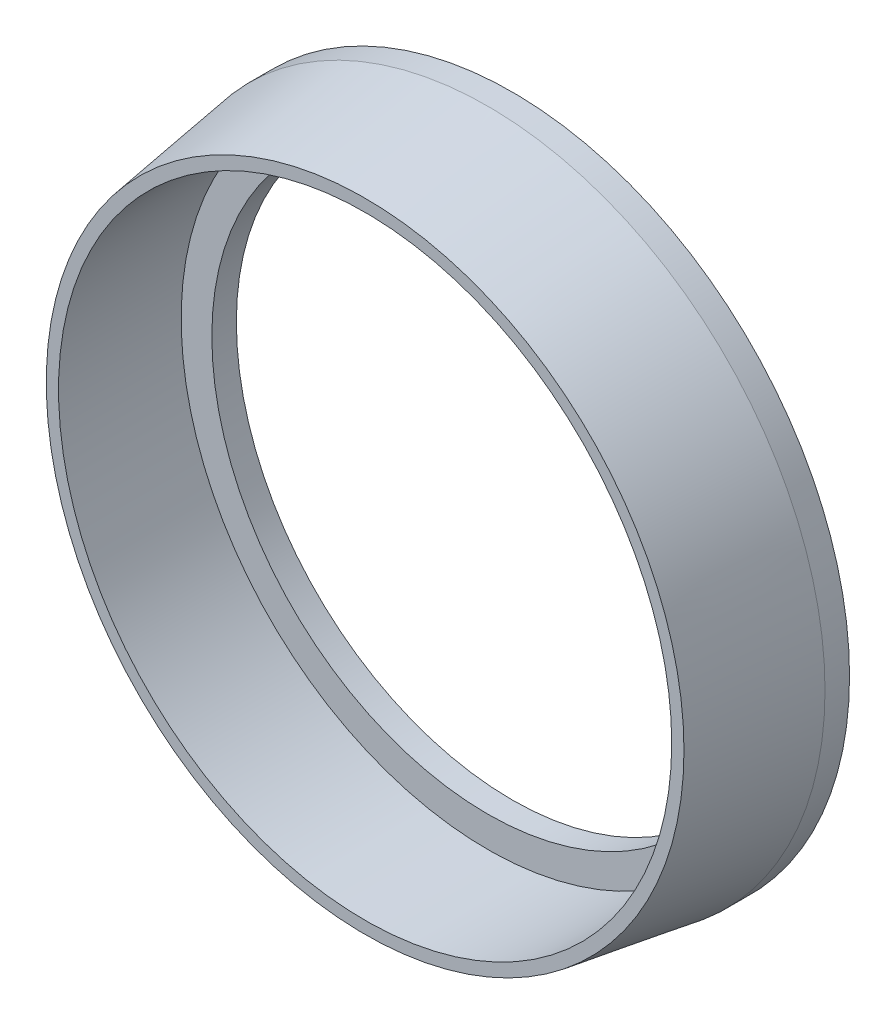
ISO-10303-21;
HEADER;
FILE_DESCRIPTION(('STEP AP214'),'2;1');
FILE_NAME('part.step','',(''),(''),'','','');
FILE_SCHEMA(('AUTOMOTIVE_DESIGN { 1 0 10303 214 1 1 1 1 }'));
ENDSEC;
DATA;
#1=APPLICATION_CONTEXT('core data for automotive mechanical design processes');
#2=APPLICATION_PROTOCOL_DEFINITION('international standard','automotive_design',2000,#1);
#3=PRODUCT_CONTEXT('',#1,'mechanical');
#4=PRODUCT('Part','Part','',(#3));
#5=PRODUCT_RELATED_PRODUCT_CATEGORY('part','',(#4));
#6=PRODUCT_DEFINITION_FORMATION('','',#4);
#7=PRODUCT_DEFINITION_CONTEXT('part definition',#1,'design');
#8=PRODUCT_DEFINITION('design','',#6,#7);
#9=PRODUCT_DEFINITION_SHAPE('','',#8);
#10=(LENGTH_UNIT() NAMED_UNIT(*) SI_UNIT(.MILLI.,.METRE.));
#11=(NAMED_UNIT(*) PLANE_ANGLE_UNIT() SI_UNIT($,.RADIAN.));
#12=(NAMED_UNIT(*) SI_UNIT($,.STERADIAN.) SOLID_ANGLE_UNIT());
#13=UNCERTAINTY_MEASURE_WITH_UNIT(LENGTH_MEASURE(1.E-05),#10,'distance_accuracy_value','');
#14=(GEOMETRIC_REPRESENTATION_CONTEXT(3) GLOBAL_UNCERTAINTY_ASSIGNED_CONTEXT((#13)) GLOBAL_UNIT_ASSIGNED_CONTEXT((#10,
#11,#12)) REPRESENTATION_CONTEXT('',''));
#15=CARTESIAN_POINT('',(0.,0.,0.));
#16=DIRECTION('',(0.,0.,1.));
#17=DIRECTION('',(1.,0.,0.));
#18=AXIS2_PLACEMENT_3D('',#15,#16,#17);
#19=CARTESIAN_POINT('',(0.,0.,10.));
#20=DIRECTION('',(0.,0.,-1.));
#21=DIRECTION('',(-1.,0.,0.));
#22=AXIS2_PLACEMENT_3D('',#19,#20,#21);
#23=CONICAL_SURFACE('',#22,26.,0.148889947609497);
#24=CARTESIAN_POINT('',(0.,0.,0.));
#25=DIRECTION('',(0.,0.,1.));
#26=DIRECTION('',(1.,0.,0.));
#27=AXIS2_PLACEMENT_3D('',#24,#25,#26);
#28=CIRCLE('',#27,27.5);
#29=CARTESIAN_POINT('',(27.5,0.,0.));
#30=VERTEX_POINT('',#29);
#31=EDGE_CURVE('E59',#30,#30,#28,.T.);
#32=ORIENTED_EDGE('',*,*,#31,.T.);
#33=EDGE_LOOP('',(#32));
#34=FACE_BOUND('',#33,.T.);
#35=CARTESIAN_POINT('',(0.,0.,10.));
#36=DIRECTION('',(0.,0.,1.));
#37=DIRECTION('',(1.,0.,0.));
#38=AXIS2_PLACEMENT_3D('',#35,#36,#37);
#39=CIRCLE('',#38,26.);
#40=CARTESIAN_POINT('',(26.,0.,10.));
#41=VERTEX_POINT('',#40);
#42=EDGE_CURVE('E10',#41,#41,#39,.T.);
#43=ORIENTED_EDGE('',*,*,#42,.F.);
#44=EDGE_LOOP('',(#43));
#45=FACE_BOUND('',#44,.T.);
#46=ADVANCED_FACE('F39',(#34,#45),#23,.T.);
#47=CARTESIAN_POINT('',(0.,0.,10.));
#48=DIRECTION('',(0.,0.,1.));
#49=DIRECTION('',(1.,0.,0.));
#50=AXIS2_PLACEMENT_3D('',#47,#48,#49);
#51=PLANE('',#50);
#52=ORIENTED_EDGE('',*,*,#42,.T.);
#53=EDGE_LOOP('',(#52));
#54=FACE_BOUND('',#53,.T.);
#55=CARTESIAN_POINT('',(0.,0.,10.));
#56=DIRECTION('',(0.,0.,1.));
#57=DIRECTION('',(1.,0.,0.));
#58=AXIS2_PLACEMENT_3D('',#55,#56,#57);
#59=CIRCLE('',#58,25.);
#60=CARTESIAN_POINT('',(25.,0.,10.));
#61=VERTEX_POINT('',#60);
#62=EDGE_CURVE('E46',#61,#61,#59,.T.);
#63=ORIENTED_EDGE('',*,*,#62,.F.);
#64=EDGE_LOOP('',(#63));
#65=FACE_BOUND('',#64,.T.);
#66=ADVANCED_FACE('F93',(#54,#65),#51,.T.);
#67=CARTESIAN_POINT('',(0.,0.,10.));
#68=DIRECTION('',(0.,0.,1.));
#69=DIRECTION('',(1.,0.,0.));
#70=AXIS2_PLACEMENT_3D('',#67,#68,#69);
#71=CYLINDRICAL_SURFACE('',#70,25.);
#72=CARTESIAN_POINT('',(0.,0.,0.));
#73=DIRECTION('',(0.,0.,1.));
#74=DIRECTION('',(1.,0.,0.));
#75=AXIS2_PLACEMENT_3D('',#72,#73,#74);
#76=CIRCLE('',#75,25.);
#77=CARTESIAN_POINT('',(25.,0.,0.));
#78=VERTEX_POINT('',#77);
#79=EDGE_CURVE('E51',#78,#78,#76,.T.);
#80=ORIENTED_EDGE('',*,*,#79,.F.);
#81=EDGE_LOOP('',(#80));
#82=FACE_BOUND('',#81,.T.);
#83=ORIENTED_EDGE('',*,*,#62,.T.);
#84=EDGE_LOOP('',(#83));
#85=FACE_BOUND('',#84,.T.);
#86=ADVANCED_FACE('F88',(#82,#85),#71,.F.);
#87=CARTESIAN_POINT('',(0.,0.,0.));
#88=DIRECTION('',(0.,0.,1.));
#89=DIRECTION('',(1.,0.,0.));
#90=AXIS2_PLACEMENT_3D('',#87,#88,#89);
#91=PLANE('',#90);
#92=CARTESIAN_POINT('',(0.,0.,0.));
#93=DIRECTION('',(0.,0.,1.));
#94=DIRECTION('',(1.,0.,0.));
#95=AXIS2_PLACEMENT_3D('',#92,#93,#94);
#96=CIRCLE('',#95,22.5);
#97=CARTESIAN_POINT('',(22.5,0.,0.));
#98=VERTEX_POINT('',#97);
#99=EDGE_CURVE('E67',#98,#98,#96,.T.);
#100=ORIENTED_EDGE('',*,*,#99,.F.);
#101=EDGE_LOOP('',(#100));
#102=FACE_BOUND('',#101,.T.);
#103=ORIENTED_EDGE('',*,*,#79,.T.);
#104=EDGE_LOOP('',(#103));
#105=FACE_BOUND('',#104,.T.);
#106=ADVANCED_FACE('F84',(#102,#105),#91,.T.);
#107=CARTESIAN_POINT('',(0.,0.,-2.));
#108=DIRECTION('',(0.,0.,1.));
#109=DIRECTION('',(1.,0.,0.));
#110=AXIS2_PLACEMENT_3D('',#107,#108,#109);
#111=CYLINDRICAL_SURFACE('',#110,27.5);
#112=CARTESIAN_POINT('',(0.,0.,-2.));
#113=DIRECTION('',(0.,0.,1.));
#114=DIRECTION('',(1.,0.,0.));
#115=AXIS2_PLACEMENT_3D('',#112,#113,#114);
#116=CIRCLE('',#115,27.5);
#117=CARTESIAN_POINT('',(27.5,0.,-2.));
#118=VERTEX_POINT('',#117);
#119=EDGE_CURVE('E56',#118,#118,#116,.T.);
#120=ORIENTED_EDGE('',*,*,#119,.T.);
#121=EDGE_LOOP('',(#120));
#122=FACE_BOUND('',#121,.T.);
#123=ORIENTED_EDGE('',*,*,#31,.F.);
#124=EDGE_LOOP('',(#123));
#125=FACE_BOUND('',#124,.T.);
#126=ADVANCED_FACE('F87',(#122,#125),#111,.T.);
#127=CARTESIAN_POINT('',(0.,0.,-2.));
#128=DIRECTION('',(0.,0.,1.));
#129=DIRECTION('',(1.,0.,0.));
#130=AXIS2_PLACEMENT_3D('',#127,#128,#129);
#131=PLANE('',#130);
#132=CARTESIAN_POINT('',(0.,0.,-2.));
#133=DIRECTION('',(0.,0.,1.));
#134=DIRECTION('',(1.,0.,0.));
#135=AXIS2_PLACEMENT_3D('',#132,#133,#134);
#136=CIRCLE('',#135,22.5);
#137=CARTESIAN_POINT('',(22.5,0.,-2.));
#138=VERTEX_POINT('',#137);
#139=EDGE_CURVE('E63',#138,#138,#136,.T.);
#140=ORIENTED_EDGE('',*,*,#139,.T.);
#141=EDGE_LOOP('',(#140));
#142=FACE_BOUND('',#141,.T.);
#143=ORIENTED_EDGE('',*,*,#119,.F.);
#144=EDGE_LOOP('',(#143));
#145=FACE_BOUND('',#144,.T.);
#146=ADVANCED_FACE('F75',(#142,#145),#131,.F.);
#147=CARTESIAN_POINT('',(0.,0.,-2.));
#148=DIRECTION('',(0.,0.,1.));
#149=DIRECTION('',(1.,0.,0.));
#150=AXIS2_PLACEMENT_3D('',#147,#148,#149);
#151=CYLINDRICAL_SURFACE('',#150,22.5);
#152=ORIENTED_EDGE('',*,*,#139,.F.);
#153=EDGE_LOOP('',(#152));
#154=FACE_BOUND('',#153,.T.);
#155=ORIENTED_EDGE('',*,*,#99,.T.);
#156=EDGE_LOOP('',(#155));
#157=FACE_BOUND('',#156,.T.);
#158=ADVANCED_FACE('F78',(#154,#157),#151,.F.);
#159=CLOSED_SHELL('',(#46,#66,#86,#106,#126,#146,#158));
#160=MANIFOLD_SOLID_BREP('B2',#159);
#161=ADVANCED_BREP_SHAPE_REPRESENTATION('',(#18,#160),#14);
#162=SHAPE_DEFINITION_REPRESENTATION(#9,#161);
ENDSEC;
END-ISO-10303-21;
